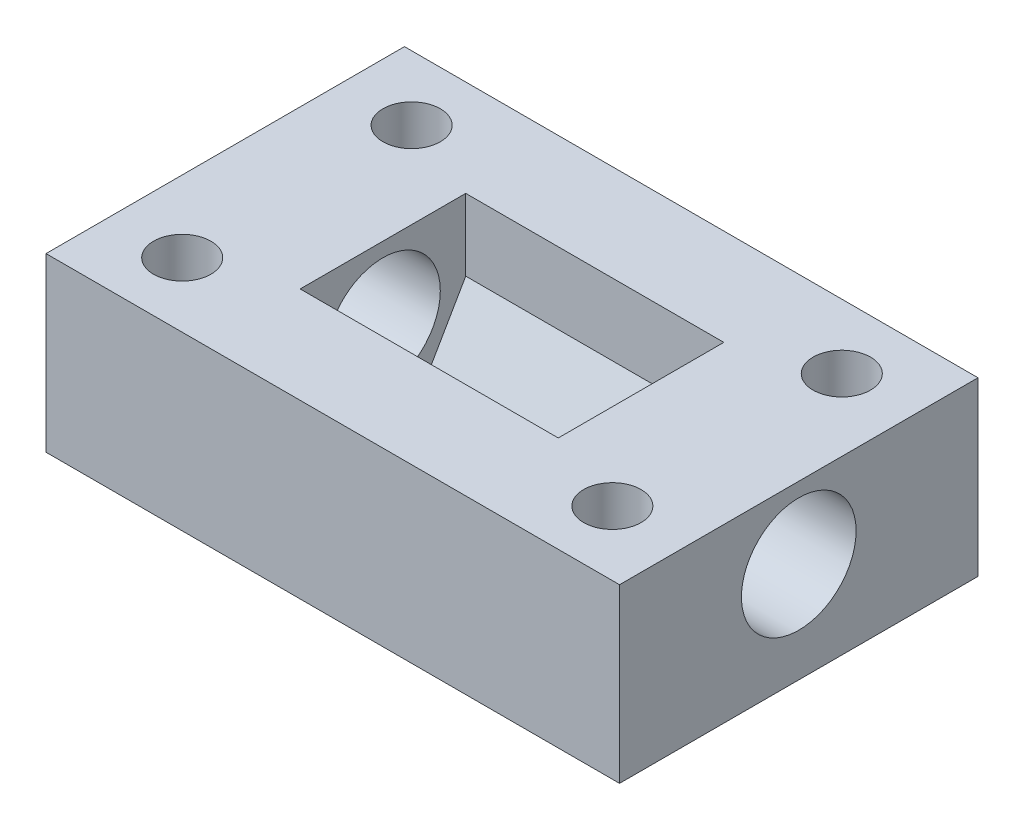
ISO-10303-21;
HEADER;
FILE_DESCRIPTION(('STEP AP214'),'2;1');
FILE_NAME('part.step','',(''),(''),'','','');
FILE_SCHEMA(('AUTOMOTIVE_DESIGN { 1 0 10303 214 1 1 1 1 }'));
ENDSEC;
DATA;
#1=APPLICATION_CONTEXT('core data for automotive mechanical design processes');
#2=APPLICATION_PROTOCOL_DEFINITION('international standard','automotive_design',2000,#1);
#3=PRODUCT_CONTEXT('',#1,'mechanical');
#4=PRODUCT('Part','Part','',(#3));
#5=PRODUCT_RELATED_PRODUCT_CATEGORY('part','',(#4));
#6=PRODUCT_DEFINITION_FORMATION('','',#4);
#7=PRODUCT_DEFINITION_CONTEXT('part definition',#1,'design');
#8=PRODUCT_DEFINITION('design','',#6,#7);
#9=PRODUCT_DEFINITION_SHAPE('','',#8);
#10=(LENGTH_UNIT() NAMED_UNIT(*) SI_UNIT(.MILLI.,.METRE.));
#11=(NAMED_UNIT(*) PLANE_ANGLE_UNIT() SI_UNIT($,.RADIAN.));
#12=(NAMED_UNIT(*) SI_UNIT($,.STERADIAN.) SOLID_ANGLE_UNIT());
#13=UNCERTAINTY_MEASURE_WITH_UNIT(LENGTH_MEASURE(1.E-05),#10,'distance_accuracy_value','');
#14=(GEOMETRIC_REPRESENTATION_CONTEXT(3) GLOBAL_UNCERTAINTY_ASSIGNED_CONTEXT((#13)) GLOBAL_UNIT_ASSIGNED_CONTEXT((#10,
#11,#12)) REPRESENTATION_CONTEXT('',''));
#15=CARTESIAN_POINT('',(0.,0.,0.));
#16=DIRECTION('',(0.,0.,1.));
#17=DIRECTION('',(1.,0.,0.));
#18=AXIS2_PLACEMENT_3D('',#15,#16,#17);
#19=CARTESIAN_POINT('',(-20.,12.,12.5));
#20=DIRECTION('',(1.,0.,0.));
#21=DIRECTION('',(0.,0.,-1.));
#22=AXIS2_PLACEMENT_3D('',#19,#20,#21);
#23=PLANE('',#22);
#24=CARTESIAN_POINT('',(-20.,7.,0.));
#25=DIRECTION('',(1.,0.,0.));
#26=DIRECTION('',(0.,0.,-1.));
#27=AXIS2_PLACEMENT_3D('',#24,#25,#26);
#28=CIRCLE('',#27,4.);
#29=CARTESIAN_POINT('',(-20.,7.,-3.99999999999999));
#30=VERTEX_POINT('',#29);
#31=EDGE_CURVE('E231',#30,#30,#28,.T.);
#32=ORIENTED_EDGE('',*,*,#31,.T.);
#33=EDGE_LOOP('',(#32));
#34=FACE_BOUND('',#33,.T.);
#35=DIRECTION('',(0.,0.,1.));
#36=VECTOR('',#35,1.);
#37=CARTESIAN_POINT('',(-20.,0.,12.5));
#38=LINE('',#37,#36);
#39=CARTESIAN_POINT('',(-20.,0.,-12.5));
#40=VERTEX_POINT('',#39);
#41=CARTESIAN_POINT('',(-20.,0.,12.5));
#42=VERTEX_POINT('',#41);
#43=EDGE_CURVE('E135',#40,#42,#38,.T.);
#44=ORIENTED_EDGE('',*,*,#43,.T.);
#45=DIRECTION('',(0.,-1.,0.));
#46=VECTOR('',#45,1.);
#47=CARTESIAN_POINT('',(-20.,12.,12.5));
#48=LINE('',#47,#46);
#49=CARTESIAN_POINT('',(-20.,12.,12.5));
#50=VERTEX_POINT('',#49);
#51=EDGE_CURVE('E11',#50,#42,#48,.T.);
#52=ORIENTED_EDGE('',*,*,#51,.F.);
#53=DIRECTION('',(0.,0.,1.));
#54=VECTOR('',#53,1.);
#55=CARTESIAN_POINT('',(-20.,12.,12.5));
#56=LINE('',#55,#54);
#57=CARTESIAN_POINT('',(-20.,12.,-12.5));
#58=VERTEX_POINT('',#57);
#59=EDGE_CURVE('E181',#58,#50,#56,.T.);
#60=ORIENTED_EDGE('',*,*,#59,.F.);
#61=DIRECTION('',(0.,-1.,0.));
#62=VECTOR('',#61,1.);
#63=CARTESIAN_POINT('',(-20.,12.,-12.5));
#64=LINE('',#63,#62);
#65=EDGE_CURVE('E187',#58,#40,#64,.T.);
#66=ORIENTED_EDGE('',*,*,#65,.T.);
#67=EDGE_LOOP('',(#44,#52,#60,#66));
#68=FACE_BOUND('',#67,.T.);
#69=ADVANCED_FACE('F37',(#34,#68),#23,.F.);
#70=CARTESIAN_POINT('',(20.,12.,12.5));
#71=DIRECTION('',(0.,0.,-1.));
#72=DIRECTION('',(-1.,0.,0.));
#73=AXIS2_PLACEMENT_3D('',#70,#71,#72);
#74=PLANE('',#73);
#75=DIRECTION('',(1.,0.,0.));
#76=VECTOR('',#75,1.);
#77=CARTESIAN_POINT('',(20.,0.,12.5));
#78=LINE('',#77,#76);
#79=CARTESIAN_POINT('',(20.,0.,12.5));
#80=VERTEX_POINT('',#79);
#81=EDGE_CURVE('E190',#42,#80,#78,.T.);
#82=ORIENTED_EDGE('',*,*,#81,.T.);
#83=DIRECTION('',(0.,-1.,0.));
#84=VECTOR('',#83,1.);
#85=CARTESIAN_POINT('',(20.,12.,12.5));
#86=LINE('',#85,#84);
#87=CARTESIAN_POINT('',(20.,12.,12.5));
#88=VERTEX_POINT('',#87);
#89=EDGE_CURVE('E45',#88,#80,#86,.T.);
#90=ORIENTED_EDGE('',*,*,#89,.F.);
#91=DIRECTION('',(1.,0.,0.));
#92=VECTOR('',#91,1.);
#93=CARTESIAN_POINT('',(20.,12.,12.5));
#94=LINE('',#93,#92);
#95=EDGE_CURVE('E89',#50,#88,#94,.T.);
#96=ORIENTED_EDGE('',*,*,#95,.F.);
#97=ORIENTED_EDGE('',*,*,#51,.T.);
#98=EDGE_LOOP('',(#82,#90,#96,#97));
#99=FACE_BOUND('',#98,.T.);
#100=ADVANCED_FACE('F220',(#99),#74,.F.);
#101=CARTESIAN_POINT('',(20.,12.,12.5));
#102=DIRECTION('',(-1.,0.,0.));
#103=DIRECTION('',(0.,0.,1.));
#104=AXIS2_PLACEMENT_3D('',#101,#102,#103);
#105=PLANE('',#104);
#106=CARTESIAN_POINT('',(20.,7.,0.));
#107=DIRECTION('',(1.,0.,0.));
#108=DIRECTION('',(0.,0.,-1.));
#109=AXIS2_PLACEMENT_3D('',#106,#107,#108);
#110=CIRCLE('',#109,4.);
#111=CARTESIAN_POINT('',(20.,7.,-3.99999999999999));
#112=VERTEX_POINT('',#111);
#113=EDGE_CURVE('E233',#112,#112,#110,.T.);
#114=ORIENTED_EDGE('',*,*,#113,.F.);
#115=EDGE_LOOP('',(#114));
#116=FACE_BOUND('',#115,.T.);
#117=DIRECTION('',(0.,0.,-1.));
#118=VECTOR('',#117,1.);
#119=CARTESIAN_POINT('',(20.,0.,12.5));
#120=LINE('',#119,#118);
#121=CARTESIAN_POINT('',(20.,0.,-12.5));
#122=VERTEX_POINT('',#121);
#123=EDGE_CURVE('E192',#80,#122,#120,.T.);
#124=ORIENTED_EDGE('',*,*,#123,.T.);
#125=DIRECTION('',(0.,-1.,0.));
#126=VECTOR('',#125,1.);
#127=CARTESIAN_POINT('',(20.,12.,-12.5));
#128=LINE('',#127,#126);
#129=CARTESIAN_POINT('',(20.,12.,-12.5));
#130=VERTEX_POINT('',#129);
#131=EDGE_CURVE('E196',#130,#122,#128,.T.);
#132=ORIENTED_EDGE('',*,*,#131,.F.);
#133=DIRECTION('',(0.,0.,-1.));
#134=VECTOR('',#133,1.);
#135=CARTESIAN_POINT('',(20.,12.,12.5));
#136=LINE('',#135,#134);
#137=EDGE_CURVE('E184',#88,#130,#136,.T.);
#138=ORIENTED_EDGE('',*,*,#137,.F.);
#139=ORIENTED_EDGE('',*,*,#89,.T.);
#140=EDGE_LOOP('',(#124,#132,#138,#139));
#141=FACE_BOUND('',#140,.T.);
#142=ADVANCED_FACE('F202',(#116,#141),#105,.F.);
#143=CARTESIAN_POINT('',(20.,12.,-12.5));
#144=DIRECTION('',(0.,0.,1.));
#145=DIRECTION('',(1.,0.,0.));
#146=AXIS2_PLACEMENT_3D('',#143,#144,#145);
#147=PLANE('',#146);
#148=DIRECTION('',(-1.,0.,0.));
#149=VECTOR('',#148,1.);
#150=CARTESIAN_POINT('',(20.,0.,-12.5));
#151=LINE('',#150,#149);
#152=EDGE_CURVE('E82',#122,#40,#151,.T.);
#153=ORIENTED_EDGE('',*,*,#152,.T.);
#154=ORIENTED_EDGE('',*,*,#65,.F.);
#155=DIRECTION('',(-1.,0.,0.));
#156=VECTOR('',#155,1.);
#157=CARTESIAN_POINT('',(20.,12.,-12.5));
#158=LINE('',#157,#156);
#159=EDGE_CURVE('E61',#130,#58,#158,.T.);
#160=ORIENTED_EDGE('',*,*,#159,.F.);
#161=ORIENTED_EDGE('',*,*,#131,.T.);
#162=EDGE_LOOP('',(#153,#154,#160,#161));
#163=FACE_BOUND('',#162,.T.);
#164=ADVANCED_FACE('F210',(#163),#147,.F.);
#165=CARTESIAN_POINT('',(0.,12.,0.));
#166=DIRECTION('',(0.,1.,0.));
#167=DIRECTION('',(0.,0.,1.));
#168=AXIS2_PLACEMENT_3D('',#165,#166,#167);
#169=PLANE('',#168);
#170=CARTESIAN_POINT('',(-15.,12.,8.));
#171=DIRECTION('',(0.,1.,0.));
#172=DIRECTION('',(0.,0.,-1.));
#173=AXIS2_PLACEMENT_3D('',#170,#171,#172);
#174=CIRCLE('',#173,2.);
#175=CARTESIAN_POINT('',(-15.,12.,6.));
#176=VERTEX_POINT('',#175);
#177=EDGE_CURVE('E245',#176,#176,#174,.T.);
#178=ORIENTED_EDGE('',*,*,#177,.F.);
#179=EDGE_LOOP('',(#178));
#180=FACE_BOUND('',#179,.T.);
#181=CARTESIAN_POINT('',(15.,12.,8.));
#182=DIRECTION('',(0.,1.,0.));
#183=DIRECTION('',(0.,0.,1.));
#184=AXIS2_PLACEMENT_3D('',#181,#182,#183);
#185=CIRCLE('',#184,2.);
#186=CARTESIAN_POINT('',(15.,12.,10.));
#187=VERTEX_POINT('',#186);
#188=EDGE_CURVE('E251',#187,#187,#185,.T.);
#189=ORIENTED_EDGE('',*,*,#188,.F.);
#190=EDGE_LOOP('',(#189));
#191=FACE_BOUND('',#190,.T.);
#192=CARTESIAN_POINT('',(15.,12.,-8.));
#193=DIRECTION('',(0.,1.,0.));
#194=DIRECTION('',(0.,0.,-1.));
#195=AXIS2_PLACEMENT_3D('',#192,#193,#194);
#196=CIRCLE('',#195,2.);
#197=CARTESIAN_POINT('',(15.,12.,-10.));
#198=VERTEX_POINT('',#197);
#199=EDGE_CURVE('E257',#198,#198,#196,.T.);
#200=ORIENTED_EDGE('',*,*,#199,.F.);
#201=EDGE_LOOP('',(#200));
#202=FACE_BOUND('',#201,.T.);
#203=CARTESIAN_POINT('',(-15.,12.,-8.));
#204=DIRECTION('',(0.,1.,0.));
#205=DIRECTION('',(0.,0.,1.));
#206=AXIS2_PLACEMENT_3D('',#203,#204,#205);
#207=CIRCLE('',#206,2.);
#208=CARTESIAN_POINT('',(-15.,12.,-6.));
#209=VERTEX_POINT('',#208);
#210=EDGE_CURVE('E239',#209,#209,#207,.T.);
#211=ORIENTED_EDGE('',*,*,#210,.F.);
#212=EDGE_LOOP('',(#211));
#213=FACE_BOUND('',#212,.T.);
#214=DIRECTION('',(0.,0.,1.));
#215=VECTOR('',#214,1.);
#216=CARTESIAN_POINT('',(9.,12.,-5.77350269189626));
#217=LINE('',#216,#215);
#218=CARTESIAN_POINT('',(9.,12.,-5.77350269189626));
#219=VERTEX_POINT('',#218);
#220=CARTESIAN_POINT('',(9.,12.,5.77350269189625));
#221=VERTEX_POINT('',#220);
#222=EDGE_CURVE('E166',#219,#221,#217,.T.);
#223=ORIENTED_EDGE('',*,*,#222,.T.);
#224=DIRECTION('',(-1.,0.,0.));
#225=VECTOR('',#224,1.);
#226=CARTESIAN_POINT('',(9.,12.,5.77350269189625));
#227=LINE('',#226,#225);
#228=CARTESIAN_POINT('',(-9.,12.,5.77350269189625));
#229=VERTEX_POINT('',#228);
#230=EDGE_CURVE('E173',#221,#229,#227,.T.);
#231=ORIENTED_EDGE('',*,*,#230,.T.);
#232=DIRECTION('',(0.,0.,1.));
#233=VECTOR('',#232,1.);
#234=CARTESIAN_POINT('',(-9.,12.,-5.77350269189626));
#235=LINE('',#234,#233);
#236=CARTESIAN_POINT('',(-9.,12.,-5.77350269189626));
#237=VERTEX_POINT('',#236);
#238=EDGE_CURVE('E156',#237,#229,#235,.T.);
#239=ORIENTED_EDGE('',*,*,#238,.F.);
#240=DIRECTION('',(-1.,0.,0.));
#241=VECTOR('',#240,1.);
#242=CARTESIAN_POINT('',(9.,12.,-5.77350269189626));
#243=LINE('',#242,#241);
#244=EDGE_CURVE('E176',#219,#237,#243,.T.);
#245=ORIENTED_EDGE('',*,*,#244,.F.);
#246=EDGE_LOOP('',(#223,#231,#239,#245));
#247=FACE_BOUND('',#246,.T.);
#248=ORIENTED_EDGE('',*,*,#59,.T.);
#249=ORIENTED_EDGE('',*,*,#95,.T.);
#250=ORIENTED_EDGE('',*,*,#137,.T.);
#251=ORIENTED_EDGE('',*,*,#159,.T.);
#252=EDGE_LOOP('',(#248,#249,#250,#251));
#253=FACE_BOUND('',#252,.T.);
#254=ADVANCED_FACE('F212',(#180,#191,#202,#213,#247,#253),#169,.T.);
#255=CARTESIAN_POINT('',(0.,0.,0.));
#256=DIRECTION('',(0.,1.,0.));
#257=DIRECTION('',(0.,0.,1.));
#258=AXIS2_PLACEMENT_3D('',#255,#256,#257);
#259=PLANE('',#258);
#260=CARTESIAN_POINT('',(-15.,0.,8.));
#261=DIRECTION('',(0.,1.,0.));
#262=DIRECTION('',(0.,0.,-1.));
#263=AXIS2_PLACEMENT_3D('',#260,#261,#262);
#264=CIRCLE('',#263,2.);
#265=CARTESIAN_POINT('',(-15.,0.,6.));
#266=VERTEX_POINT('',#265);
#267=EDGE_CURVE('E248',#266,#266,#264,.T.);
#268=ORIENTED_EDGE('',*,*,#267,.T.);
#269=EDGE_LOOP('',(#268));
#270=FACE_BOUND('',#269,.T.);
#271=CARTESIAN_POINT('',(15.,0.,8.));
#272=DIRECTION('',(0.,1.,0.));
#273=DIRECTION('',(0.,0.,1.));
#274=AXIS2_PLACEMENT_3D('',#271,#272,#273);
#275=CIRCLE('',#274,2.);
#276=CARTESIAN_POINT('',(15.,0.,10.));
#277=VERTEX_POINT('',#276);
#278=EDGE_CURVE('E254',#277,#277,#275,.T.);
#279=ORIENTED_EDGE('',*,*,#278,.T.);
#280=EDGE_LOOP('',(#279));
#281=FACE_BOUND('',#280,.T.);
#282=CARTESIAN_POINT('',(15.,0.,-8.));
#283=DIRECTION('',(0.,1.,0.));
#284=DIRECTION('',(0.,0.,-1.));
#285=AXIS2_PLACEMENT_3D('',#282,#283,#284);
#286=CIRCLE('',#285,2.);
#287=CARTESIAN_POINT('',(15.,0.,-10.));
#288=VERTEX_POINT('',#287);
#289=EDGE_CURVE('E242',#288,#288,#286,.T.);
#290=ORIENTED_EDGE('',*,*,#289,.T.);
#291=EDGE_LOOP('',(#290));
#292=FACE_BOUND('',#291,.T.);
#293=CARTESIAN_POINT('',(-15.,0.,-8.));
#294=DIRECTION('',(0.,1.,0.));
#295=DIRECTION('',(0.,0.,1.));
#296=AXIS2_PLACEMENT_3D('',#293,#294,#295);
#297=CIRCLE('',#296,2.);
#298=CARTESIAN_POINT('',(-15.,0.,-6.));
#299=VERTEX_POINT('',#298);
#300=EDGE_CURVE('E236',#299,#299,#297,.T.);
#301=ORIENTED_EDGE('',*,*,#300,.T.);
#302=EDGE_LOOP('',(#301));
#303=FACE_BOUND('',#302,.T.);
#304=ORIENTED_EDGE('',*,*,#43,.F.);
#305=ORIENTED_EDGE('',*,*,#152,.F.);
#306=ORIENTED_EDGE('',*,*,#123,.F.);
#307=ORIENTED_EDGE('',*,*,#81,.F.);
#308=EDGE_LOOP('',(#304,#305,#306,#307));
#309=FACE_BOUND('',#308,.T.);
#310=ADVANCED_FACE('F206',(#270,#281,#292,#303,#309),#259,.F.);
#311=CARTESIAN_POINT('',(9.,6.99999999999999,5.77350269189625));
#312=DIRECTION('',(0.,0.5,-0.866025403784438));
#313=DIRECTION('',(0.,0.866025403784439,0.5));
#314=AXIS2_PLACEMENT_3D('',#311,#312,#313);
#315=PLANE('',#314);
#316=DIRECTION('',(-1.,0.,0.));
#317=VECTOR('',#316,1.);
#318=CARTESIAN_POINT('',(9.,6.99999999999999,5.77350269189625));
#319=LINE('',#318,#317);
#320=CARTESIAN_POINT('',(9.,6.99999999999999,5.77350269189625));
#321=VERTEX_POINT('',#320);
#322=CARTESIAN_POINT('',(-9.,6.99999999999999,5.77350269189625));
#323=VERTEX_POINT('',#322);
#324=EDGE_CURVE('E171',#321,#323,#319,.T.);
#325=ORIENTED_EDGE('',*,*,#324,.F.);
#326=DIRECTION('',(0.,-0.866025403784439,-0.5));
#327=VECTOR('',#326,1.);
#328=CARTESIAN_POINT('',(9.,6.99999999999999,5.77350269189625));
#329=LINE('',#328,#327);
#330=CARTESIAN_POINT('',(9.,2.,2.88675134594813));
#331=VERTEX_POINT('',#330);
#332=EDGE_CURVE('E133',#321,#331,#329,.T.);
#333=ORIENTED_EDGE('',*,*,#332,.T.);
#334=DIRECTION('',(-1.,0.,0.));
#335=VECTOR('',#334,1.);
#336=CARTESIAN_POINT('',(9.,2.,2.88675134594813));
#337=LINE('',#336,#335);
#338=CARTESIAN_POINT('',(-9.,2.,2.88675134594813));
#339=VERTEX_POINT('',#338);
#340=EDGE_CURVE('E125',#331,#339,#337,.T.);
#341=ORIENTED_EDGE('',*,*,#340,.T.);
#342=DIRECTION('',(0.,-0.866025403784439,-0.5));
#343=VECTOR('',#342,1.);
#344=CARTESIAN_POINT('',(-9.,6.99999999999999,5.77350269189625));
#345=LINE('',#344,#343);
#346=EDGE_CURVE('E130',#323,#339,#345,.T.);
#347=ORIENTED_EDGE('',*,*,#346,.F.);
#348=EDGE_LOOP('',(#325,#333,#341,#347));
#349=FACE_BOUND('',#348,.T.);
#350=ADVANCED_FACE('F128',(#349),#315,.T.);
#351=CARTESIAN_POINT('',(9.,2.,2.88675134594813));
#352=DIRECTION('',(0.,1.,0.));
#353=DIRECTION('',(0.,0.,1.));
#354=AXIS2_PLACEMENT_3D('',#351,#352,#353);
#355=PLANE('',#354);
#356=ORIENTED_EDGE('',*,*,#340,.F.);
#357=DIRECTION('',(0.,0.,-1.));
#358=VECTOR('',#357,1.);
#359=CARTESIAN_POINT('',(9.,2.,2.88675134594813));
#360=LINE('',#359,#358);
#361=CARTESIAN_POINT('',(9.,2.,-2.88675134594814));
#362=VERTEX_POINT('',#361);
#363=EDGE_CURVE('E160',#331,#362,#360,.T.);
#364=ORIENTED_EDGE('',*,*,#363,.T.);
#365=DIRECTION('',(-1.,0.,0.));
#366=VECTOR('',#365,1.);
#367=CARTESIAN_POINT('',(9.,2.,-2.88675134594814));
#368=LINE('',#367,#366);
#369=CARTESIAN_POINT('',(-9.,2.,-2.88675134594814));
#370=VERTEX_POINT('',#369);
#371=EDGE_CURVE('E136',#362,#370,#368,.T.);
#372=ORIENTED_EDGE('',*,*,#371,.T.);
#373=DIRECTION('',(0.,0.,-1.));
#374=VECTOR('',#373,1.);
#375=CARTESIAN_POINT('',(-9.,2.,2.88675134594813));
#376=LINE('',#375,#374);
#377=EDGE_CURVE('E139',#339,#370,#376,.T.);
#378=ORIENTED_EDGE('',*,*,#377,.F.);
#379=EDGE_LOOP('',(#356,#364,#372,#378));
#380=FACE_BOUND('',#379,.T.);
#381=ADVANCED_FACE('F140',(#380),#355,.T.);
#382=CARTESIAN_POINT('',(9.,2.,-2.88675134594814));
#383=DIRECTION('',(0.,0.499999999999999,0.866025403784439));
#384=DIRECTION('',(0.,-0.866025403784439,0.499999999999999));
#385=AXIS2_PLACEMENT_3D('',#382,#383,#384);
#386=PLANE('',#385);
#387=ORIENTED_EDGE('',*,*,#371,.F.);
#388=DIRECTION('',(0.,0.866025403784439,-0.499999999999999));
#389=VECTOR('',#388,1.);
#390=CARTESIAN_POINT('',(9.,2.,-2.88675134594814));
#391=LINE('',#390,#389);
#392=CARTESIAN_POINT('',(9.,7.,-5.77350269189626));
#393=VERTEX_POINT('',#392);
#394=EDGE_CURVE('E162',#362,#393,#391,.T.);
#395=ORIENTED_EDGE('',*,*,#394,.T.);
#396=DIRECTION('',(-1.,0.,0.));
#397=VECTOR('',#396,1.);
#398=CARTESIAN_POINT('',(9.,7.,-5.77350269189626));
#399=LINE('',#398,#397);
#400=CARTESIAN_POINT('',(-9.,7.,-5.77350269189626));
#401=VERTEX_POINT('',#400);
#402=EDGE_CURVE('E178',#393,#401,#399,.T.);
#403=ORIENTED_EDGE('',*,*,#402,.T.);
#404=DIRECTION('',(0.,0.866025403784439,-0.499999999999999));
#405=VECTOR('',#404,1.);
#406=CARTESIAN_POINT('',(-9.,2.,-2.88675134594814));
#407=LINE('',#406,#405);
#408=EDGE_CURVE('E143',#370,#401,#407,.T.);
#409=ORIENTED_EDGE('',*,*,#408,.F.);
#410=EDGE_LOOP('',(#387,#395,#403,#409));
#411=FACE_BOUND('',#410,.T.);
#412=ADVANCED_FACE('F295',(#411),#386,.T.);
#413=CARTESIAN_POINT('',(9.,7.,-5.77350269189626));
#414=DIRECTION('',(0.,0.,1.));
#415=DIRECTION('',(0.,-1.,0.));
#416=AXIS2_PLACEMENT_3D('',#413,#414,#415);
#417=PLANE('',#416);
#418=ORIENTED_EDGE('',*,*,#402,.F.);
#419=DIRECTION('',(0.,1.,0.));
#420=VECTOR('',#419,1.);
#421=CARTESIAN_POINT('',(9.,7.,-5.77350269189626));
#422=LINE('',#421,#420);
#423=EDGE_CURVE('E164',#393,#219,#422,.T.);
#424=ORIENTED_EDGE('',*,*,#423,.T.);
#425=ORIENTED_EDGE('',*,*,#244,.T.);
#426=DIRECTION('',(0.,1.,0.));
#427=VECTOR('',#426,1.);
#428=CARTESIAN_POINT('',(-9.,7.,-5.77350269189626));
#429=LINE('',#428,#427);
#430=EDGE_CURVE('E52',#401,#237,#429,.T.);
#431=ORIENTED_EDGE('',*,*,#430,.F.);
#432=EDGE_LOOP('',(#418,#424,#425,#431));
#433=FACE_BOUND('',#432,.T.);
#434=ADVANCED_FACE('F287',(#433),#417,.T.);
#435=CARTESIAN_POINT('',(9.,6.99999999999999,5.77350269189625));
#436=DIRECTION('',(0.,0.,-1.));
#437=DIRECTION('',(0.,1.,0.));
#438=AXIS2_PLACEMENT_3D('',#435,#436,#437);
#439=PLANE('',#438);
#440=ORIENTED_EDGE('',*,*,#230,.F.);
#441=DIRECTION('',(0.,-1.,0.));
#442=VECTOR('',#441,1.);
#443=CARTESIAN_POINT('',(9.,6.99999999999999,5.77350269189625));
#444=LINE('',#443,#442);
#445=EDGE_CURVE('E169',#221,#321,#444,.T.);
#446=ORIENTED_EDGE('',*,*,#445,.T.);
#447=ORIENTED_EDGE('',*,*,#324,.T.);
#448=DIRECTION('',(0.,-1.,0.));
#449=VECTOR('',#448,1.);
#450=CARTESIAN_POINT('',(-9.,6.99999999999999,5.77350269189625));
#451=LINE('',#450,#449);
#452=EDGE_CURVE('E147',#229,#323,#451,.T.);
#453=ORIENTED_EDGE('',*,*,#452,.F.);
#454=EDGE_LOOP('',(#440,#446,#447,#453));
#455=FACE_BOUND('',#454,.T.);
#456=ADVANCED_FACE('F285',(#455),#439,.T.);
#457=CARTESIAN_POINT('',(9.,0.,0.));
#458=DIRECTION('',(1.,0.,0.));
#459=DIRECTION('',(0.,0.,-1.));
#460=AXIS2_PLACEMENT_3D('',#457,#458,#459);
#461=PLANE('',#460);
#462=CARTESIAN_POINT('',(9.,7.,0.));
#463=DIRECTION('',(1.,0.,0.));
#464=DIRECTION('',(0.,0.,-1.));
#465=AXIS2_PLACEMENT_3D('',#462,#463,#464);
#466=CIRCLE('',#465,4.);
#467=CARTESIAN_POINT('',(9.,7.,-3.99999999999999));
#468=VERTEX_POINT('',#467);
#469=EDGE_CURVE('E148',#468,#468,#466,.T.);
#470=ORIENTED_EDGE('',*,*,#469,.T.);
#471=EDGE_LOOP('',(#470));
#472=FACE_BOUND('',#471,.T.);
#473=ORIENTED_EDGE('',*,*,#332,.F.);
#474=ORIENTED_EDGE('',*,*,#445,.F.);
#475=ORIENTED_EDGE('',*,*,#222,.F.);
#476=ORIENTED_EDGE('',*,*,#423,.F.);
#477=ORIENTED_EDGE('',*,*,#394,.F.);
#478=ORIENTED_EDGE('',*,*,#363,.F.);
#479=EDGE_LOOP('',(#473,#474,#475,#476,#477,#478));
#480=FACE_BOUND('',#479,.T.);
#481=ADVANCED_FACE('F282',(#472,#480),#461,.F.);
#482=CARTESIAN_POINT('',(-9.,0.,0.));
#483=DIRECTION('',(1.,0.,0.));
#484=DIRECTION('',(0.,0.,-1.));
#485=AXIS2_PLACEMENT_3D('',#482,#483,#484);
#486=PLANE('',#485);
#487=CARTESIAN_POINT('',(-9.,7.,0.));
#488=DIRECTION('',(1.,0.,0.));
#489=DIRECTION('',(0.,0.,-1.));
#490=AXIS2_PLACEMENT_3D('',#487,#488,#489);
#491=CIRCLE('',#490,4.);
#492=CARTESIAN_POINT('',(-9.,7.,-3.99999999999999));
#493=VERTEX_POINT('',#492);
#494=EDGE_CURVE('E40',#493,#493,#491,.T.);
#495=ORIENTED_EDGE('',*,*,#494,.F.);
#496=EDGE_LOOP('',(#495));
#497=FACE_BOUND('',#496,.T.);
#498=ORIENTED_EDGE('',*,*,#346,.T.);
#499=ORIENTED_EDGE('',*,*,#377,.T.);
#500=ORIENTED_EDGE('',*,*,#408,.T.);
#501=ORIENTED_EDGE('',*,*,#430,.T.);
#502=ORIENTED_EDGE('',*,*,#238,.T.);
#503=ORIENTED_EDGE('',*,*,#452,.T.);
#504=EDGE_LOOP('',(#498,#499,#500,#501,#502,#503));
#505=FACE_BOUND('',#504,.T.);
#506=ADVANCED_FACE('F145',(#497,#505),#486,.T.);
#507=CARTESIAN_POINT('',(-20.,7.,0.));
#508=DIRECTION('',(1.,0.,0.));
#509=DIRECTION('',(0.,0.,-1.));
#510=AXIS2_PLACEMENT_3D('',#507,#508,#509);
#511=CYLINDRICAL_SURFACE('',#510,4.);
#512=ORIENTED_EDGE('',*,*,#494,.T.);
#513=EDGE_LOOP('',(#512));
#514=FACE_BOUND('',#513,.T.);
#515=ORIENTED_EDGE('',*,*,#31,.F.);
#516=EDGE_LOOP('',(#515));
#517=FACE_BOUND('',#516,.T.);
#518=ADVANCED_FACE('F330',(#514,#517),#511,.F.);
#519=ORIENTED_EDGE('',*,*,#113,.T.);
#520=EDGE_LOOP('',(#519));
#521=FACE_BOUND('',#520,.T.);
#522=ORIENTED_EDGE('',*,*,#469,.F.);
#523=EDGE_LOOP('',(#522));
#524=FACE_BOUND('',#523,.T.);
#525=ADVANCED_FACE('F328',(#521,#524),#511,.F.);
#526=CARTESIAN_POINT('',(-15.,0.,-8.));
#527=DIRECTION('',(0.,1.,0.));
#528=DIRECTION('',(0.,0.,1.));
#529=AXIS2_PLACEMENT_3D('',#526,#527,#528);
#530=CYLINDRICAL_SURFACE('',#529,2.);
#531=ORIENTED_EDGE('',*,*,#300,.F.);
#532=EDGE_LOOP('',(#531));
#533=FACE_BOUND('',#532,.T.);
#534=ORIENTED_EDGE('',*,*,#210,.T.);
#535=EDGE_LOOP('',(#534));
#536=FACE_BOUND('',#535,.T.);
#537=ADVANCED_FACE('F269',(#533,#536),#530,.F.);
#538=CARTESIAN_POINT('',(15.,0.,-8.));
#539=DIRECTION('',(0.,1.,0.));
#540=DIRECTION('',(0.,0.,1.));
#541=AXIS2_PLACEMENT_3D('',#538,#539,#540);
#542=CYLINDRICAL_SURFACE('',#541,2.);
#543=ORIENTED_EDGE('',*,*,#289,.F.);
#544=EDGE_LOOP('',(#543));
#545=FACE_BOUND('',#544,.T.);
#546=ORIENTED_EDGE('',*,*,#199,.T.);
#547=EDGE_LOOP('',(#546));
#548=FACE_BOUND('',#547,.T.);
#549=ADVANCED_FACE('F265',(#545,#548),#542,.F.);
#550=CARTESIAN_POINT('',(15.,0.,8.));
#551=DIRECTION('',(0.,1.,0.));
#552=DIRECTION('',(0.,0.,1.));
#553=AXIS2_PLACEMENT_3D('',#550,#551,#552);
#554=CYLINDRICAL_SURFACE('',#553,2.);
#555=ORIENTED_EDGE('',*,*,#278,.F.);
#556=EDGE_LOOP('',(#555));
#557=FACE_BOUND('',#556,.T.);
#558=ORIENTED_EDGE('',*,*,#188,.T.);
#559=EDGE_LOOP('',(#558));
#560=FACE_BOUND('',#559,.T.);
#561=ADVANCED_FACE('F268',(#557,#560),#554,.F.);
#562=CARTESIAN_POINT('',(-15.,0.,8.));
#563=DIRECTION('',(0.,1.,0.));
#564=DIRECTION('',(0.,0.,1.));
#565=AXIS2_PLACEMENT_3D('',#562,#563,#564);
#566=CYLINDRICAL_SURFACE('',#565,2.);
#567=ORIENTED_EDGE('',*,*,#267,.F.);
#568=EDGE_LOOP('',(#567));
#569=FACE_BOUND('',#568,.T.);
#570=ORIENTED_EDGE('',*,*,#177,.T.);
#571=EDGE_LOOP('',(#570));
#572=FACE_BOUND('',#571,.T.);
#573=ADVANCED_FACE('F316',(#569,#572),#566,.F.);
#574=CLOSED_SHELL('',(#69,#100,#142,#164,#254,#310,#350,#381,#412,#434,#456,#481,#506,#518,#525,
#537,#549,#561,#573));
#575=MANIFOLD_SOLID_BREP('B2',#574);
#576=ADVANCED_BREP_SHAPE_REPRESENTATION('',(#18,#575),#14);
#577=SHAPE_DEFINITION_REPRESENTATION(#9,#576);
ENDSEC;
END-ISO-10303-21;
